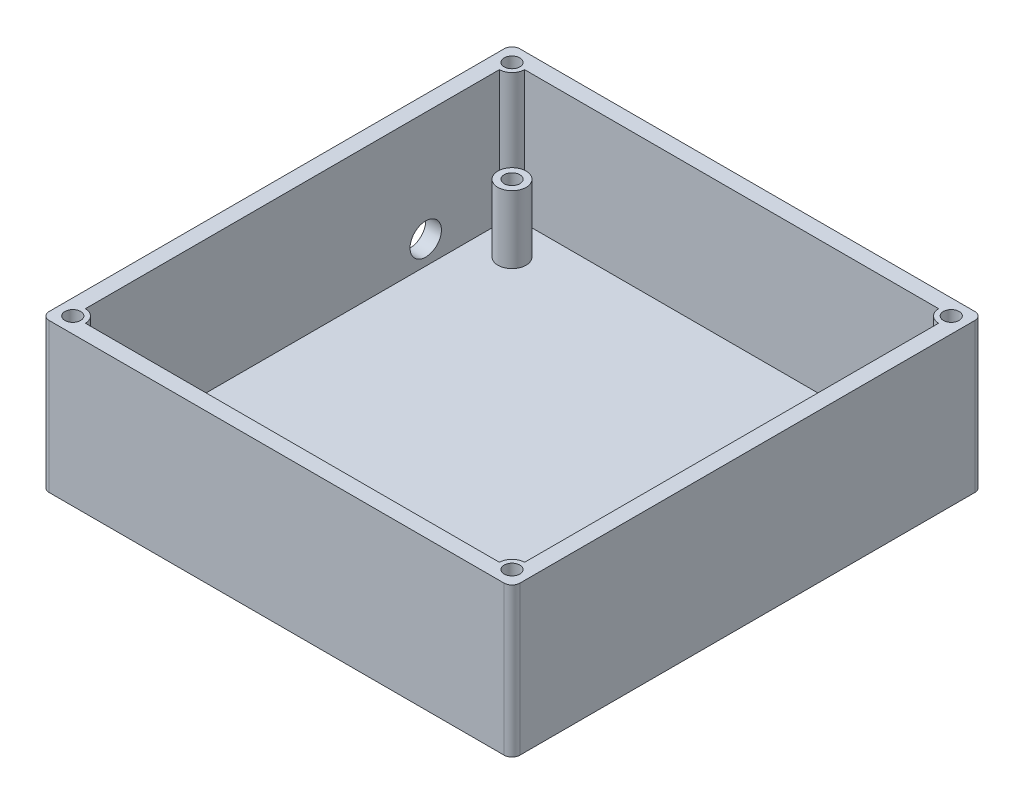
ISO-10303-21;
HEADER;
FILE_DESCRIPTION(('STEP AP214'),'2;1');
FILE_NAME('part.step','',(''),(''),'','','');
FILE_SCHEMA(('AUTOMOTIVE_DESIGN { 1 0 10303 214 1 1 1 1 }'));
ENDSEC;
DATA;
#1=APPLICATION_CONTEXT('core data for automotive mechanical design processes');
#2=APPLICATION_PROTOCOL_DEFINITION('international standard','automotive_design',2000,#1);
#3=PRODUCT_CONTEXT('',#1,'mechanical');
#4=PRODUCT('Part','Part','',(#3));
#5=PRODUCT_RELATED_PRODUCT_CATEGORY('part','',(#4));
#6=PRODUCT_DEFINITION_FORMATION('','',#4);
#7=PRODUCT_DEFINITION_CONTEXT('part definition',#1,'design');
#8=PRODUCT_DEFINITION('design','',#6,#7);
#9=PRODUCT_DEFINITION_SHAPE('','',#8);
#10=(LENGTH_UNIT() NAMED_UNIT(*) SI_UNIT(.MILLI.,.METRE.));
#11=(NAMED_UNIT(*) PLANE_ANGLE_UNIT() SI_UNIT($,.RADIAN.));
#12=(NAMED_UNIT(*) SI_UNIT($,.STERADIAN.) SOLID_ANGLE_UNIT());
#13=UNCERTAINTY_MEASURE_WITH_UNIT(LENGTH_MEASURE(1.E-05),#10,'distance_accuracy_value','');
#14=(GEOMETRIC_REPRESENTATION_CONTEXT(3) GLOBAL_UNCERTAINTY_ASSIGNED_CONTEXT((#13)) GLOBAL_UNIT_ASSIGNED_CONTEXT((#10,
#11,#12)) REPRESENTATION_CONTEXT('',''));
#15=CARTESIAN_POINT('',(0.,0.,0.));
#16=DIRECTION('',(0.,0.,1.));
#17=DIRECTION('',(1.,0.,0.));
#18=AXIS2_PLACEMENT_3D('',#15,#16,#17);
#19=CARTESIAN_POINT('',(28.,19.,28.));
#20=DIRECTION('',(0.,0.,-1.));
#21=DIRECTION('',(-1.,0.,0.));
#22=AXIS2_PLACEMENT_3D('',#19,#20,#21);
#23=PLANE('',#22);
#24=DIRECTION('',(1.,0.,0.));
#25=VECTOR('',#24,1.);
#26=CARTESIAN_POINT('',(-28.,2.,28.));
#27=LINE('',#26,#25);
#28=CARTESIAN_POINT('',(-26.4,2.,28.));
#29=VERTEX_POINT('',#28);
#30=CARTESIAN_POINT('',(26.4,2.,28.));
#31=VERTEX_POINT('',#30);
#32=EDGE_CURVE('E164',#29,#31,#27,.T.);
#33=ORIENTED_EDGE('',*,*,#32,.F.);
#34=DIRECTION('',(0.,-1.,0.));
#35=VECTOR('',#34,1.);
#36=CARTESIAN_POINT('',(-26.4,19.,28.));
#37=LINE('',#36,#35);
#38=CARTESIAN_POINT('',(-26.4,19.,28.));
#39=VERTEX_POINT('',#38);
#40=EDGE_CURVE('E174',#29,#39,#37,.F.);
#41=ORIENTED_EDGE('',*,*,#40,.T.);
#42=DIRECTION('',(1.,0.,0.));
#43=VECTOR('',#42,1.);
#44=CARTESIAN_POINT('',(28.,19.,28.));
#45=LINE('',#44,#43);
#46=CARTESIAN_POINT('',(26.4,19.,28.));
#47=VERTEX_POINT('',#46);
#48=EDGE_CURVE('E218',#39,#47,#45,.T.);
#49=ORIENTED_EDGE('',*,*,#48,.T.);
#50=DIRECTION('',(0.,-1.,0.));
#51=VECTOR('',#50,1.);
#52=CARTESIAN_POINT('',(26.4,19.,28.));
#53=LINE('',#52,#51);
#54=EDGE_CURVE('E304',#47,#31,#53,.T.);
#55=ORIENTED_EDGE('',*,*,#54,.T.);
#56=EDGE_LOOP('',(#33,#41,#49,#55));
#57=FACE_BOUND('',#56,.T.);
#58=ADVANCED_FACE('F39',(#57),#23,.T.);
#59=CARTESIAN_POINT('',(-28.,19.,28.));
#60=DIRECTION('',(1.,0.,0.));
#61=DIRECTION('',(0.,0.,-1.));
#62=AXIS2_PLACEMENT_3D('',#59,#60,#61);
#63=PLANE('',#62);
#64=CARTESIAN_POINT('',(-28.,5.,-17.));
#65=DIRECTION('',(-1.,0.,0.));
#66=DIRECTION('',(0.,0.,1.));
#67=AXIS2_PLACEMENT_3D('',#64,#65,#66);
#68=CIRCLE('',#67,2.);
#69=CARTESIAN_POINT('',(-28.,5.,-15.));
#70=VERTEX_POINT('',#69);
#71=EDGE_CURVE('E215',#70,#70,#68,.T.);
#72=ORIENTED_EDGE('',*,*,#71,.T.);
#73=EDGE_LOOP('',(#72));
#74=FACE_BOUND('',#73,.T.);
#75=DIRECTION('',(0.,0.,1.));
#76=VECTOR('',#75,1.);
#77=CARTESIAN_POINT('',(-28.,19.,28.));
#78=LINE('',#77,#76);
#79=CARTESIAN_POINT('',(-28.,19.,-26.4));
#80=VERTEX_POINT('',#79);
#81=CARTESIAN_POINT('',(-28.,19.,26.4));
#82=VERTEX_POINT('',#81);
#83=EDGE_CURVE('E170',#80,#82,#78,.T.);
#84=ORIENTED_EDGE('',*,*,#83,.T.);
#85=DIRECTION('',(0.,-1.,0.));
#86=VECTOR('',#85,1.);
#87=CARTESIAN_POINT('',(-28.,19.,26.4));
#88=LINE('',#87,#86);
#89=CARTESIAN_POINT('',(-28.,2.,26.4));
#90=VERTEX_POINT('',#89);
#91=EDGE_CURVE('E168',#82,#90,#88,.T.);
#92=ORIENTED_EDGE('',*,*,#91,.T.);
#93=DIRECTION('',(0.,0.,1.));
#94=VECTOR('',#93,1.);
#95=CARTESIAN_POINT('',(-28.,2.,28.));
#96=LINE('',#95,#94);
#97=CARTESIAN_POINT('',(-28.,2.,-26.4));
#98=VERTEX_POINT('',#97);
#99=EDGE_CURVE('E152',#98,#90,#96,.T.);
#100=ORIENTED_EDGE('',*,*,#99,.F.);
#101=DIRECTION('',(0.,-1.,0.));
#102=VECTOR('',#101,1.);
#103=CARTESIAN_POINT('',(-28.,19.,-26.4));
#104=LINE('',#103,#102);
#105=EDGE_CURVE('E302',#98,#80,#104,.F.);
#106=ORIENTED_EDGE('',*,*,#105,.T.);
#107=EDGE_LOOP('',(#84,#92,#100,#106));
#108=FACE_BOUND('',#107,.T.);
#109=ADVANCED_FACE('F169',(#74,#108),#63,.T.);
#110=CARTESIAN_POINT('',(28.,19.,-28.));
#111=DIRECTION('',(-1.,0.,0.));
#112=DIRECTION('',(0.,0.,1.));
#113=AXIS2_PLACEMENT_3D('',#110,#111,#112);
#114=PLANE('',#113);
#115=DIRECTION('',(0.,0.,-1.));
#116=VECTOR('',#115,1.);
#117=CARTESIAN_POINT('',(28.,2.,28.));
#118=LINE('',#117,#116);
#119=CARTESIAN_POINT('',(28.,2.,26.4));
#120=VERTEX_POINT('',#119);
#121=CARTESIAN_POINT('',(28.,2.,-26.4));
#122=VERTEX_POINT('',#121);
#123=EDGE_CURVE('E286',#120,#122,#118,.T.);
#124=ORIENTED_EDGE('',*,*,#123,.F.);
#125=DIRECTION('',(0.,-1.,0.));
#126=VECTOR('',#125,1.);
#127=CARTESIAN_POINT('',(28.,19.,26.4));
#128=LINE('',#127,#126);
#129=CARTESIAN_POINT('',(28.,19.,26.4));
#130=VERTEX_POINT('',#129);
#131=EDGE_CURVE('E192',#120,#130,#128,.F.);
#132=ORIENTED_EDGE('',*,*,#131,.T.);
#133=DIRECTION('',(0.,0.,-1.));
#134=VECTOR('',#133,1.);
#135=CARTESIAN_POINT('',(28.,19.,-28.));
#136=LINE('',#135,#134);
#137=CARTESIAN_POINT('',(28.,19.,-26.4));
#138=VERTEX_POINT('',#137);
#139=EDGE_CURVE('E238',#130,#138,#136,.T.);
#140=ORIENTED_EDGE('',*,*,#139,.T.);
#141=DIRECTION('',(0.,-1.,0.));
#142=VECTOR('',#141,1.);
#143=CARTESIAN_POINT('',(28.,19.,-26.4));
#144=LINE('',#143,#142);
#145=EDGE_CURVE('E200',#138,#122,#144,.T.);
#146=ORIENTED_EDGE('',*,*,#145,.T.);
#147=EDGE_LOOP('',(#124,#132,#140,#146));
#148=FACE_BOUND('',#147,.T.);
#149=ADVANCED_FACE('F379',(#148),#114,.T.);
#150=CARTESIAN_POINT('',(-28.,19.,-28.));
#151=DIRECTION('',(0.,0.,1.));
#152=DIRECTION('',(1.,0.,0.));
#153=AXIS2_PLACEMENT_3D('',#150,#151,#152);
#154=PLANE('',#153);
#155=DIRECTION('',(-1.,0.,0.));
#156=VECTOR('',#155,1.);
#157=CARTESIAN_POINT('',(-28.,2.,-28.));
#158=LINE('',#157,#156);
#159=CARTESIAN_POINT('',(26.4,2.,-28.));
#160=VERTEX_POINT('',#159);
#161=CARTESIAN_POINT('',(-26.4,2.,-28.));
#162=VERTEX_POINT('',#161);
#163=EDGE_CURVE('E165',#160,#162,#158,.T.);
#164=ORIENTED_EDGE('',*,*,#163,.F.);
#165=DIRECTION('',(0.,-1.,0.));
#166=VECTOR('',#165,1.);
#167=CARTESIAN_POINT('',(26.4,19.,-28.));
#168=LINE('',#167,#166);
#169=CARTESIAN_POINT('',(26.4,19.,-28.));
#170=VERTEX_POINT('',#169);
#171=EDGE_CURVE('E205',#160,#170,#168,.F.);
#172=ORIENTED_EDGE('',*,*,#171,.T.);
#173=DIRECTION('',(-1.,0.,0.));
#174=VECTOR('',#173,1.);
#175=CARTESIAN_POINT('',(-28.,19.,-28.));
#176=LINE('',#175,#174);
#177=CARTESIAN_POINT('',(-26.4,19.,-28.));
#178=VERTEX_POINT('',#177);
#179=EDGE_CURVE('E233',#170,#178,#176,.T.);
#180=ORIENTED_EDGE('',*,*,#179,.T.);
#181=DIRECTION('',(0.,-1.,0.));
#182=VECTOR('',#181,1.);
#183=CARTESIAN_POINT('',(-26.4,19.,-28.));
#184=LINE('',#183,#182);
#185=EDGE_CURVE('E210',#178,#162,#184,.T.);
#186=ORIENTED_EDGE('',*,*,#185,.T.);
#187=EDGE_LOOP('',(#164,#172,#180,#186));
#188=FACE_BOUND('',#187,.T.);
#189=ADVANCED_FACE('F389',(#188),#154,.T.);
#190=CARTESIAN_POINT('',(0.,2.,0.));
#191=DIRECTION('',(0.,-1.,0.));
#192=DIRECTION('',(0.,0.,-1.));
#193=AXIS2_PLACEMENT_3D('',#190,#191,#192);
#194=PLANE('',#193);
#195=CARTESIAN_POINT('',(-28.,2.,28.));
#196=DIRECTION('',(0.,1.,0.));
#197=DIRECTION('',(0.,0.,1.));
#198=AXIS2_PLACEMENT_3D('',#195,#196,#197);
#199=CIRCLE('',#198,1.6);
#200=EDGE_CURVE('E157',#29,#90,#199,.T.);
#201=ORIENTED_EDGE('',*,*,#200,.F.);
#202=ORIENTED_EDGE('',*,*,#32,.T.);
#203=CARTESIAN_POINT('',(28.,2.,28.));
#204=DIRECTION('',(0.,1.,0.));
#205=DIRECTION('',(0.,0.,1.));
#206=AXIS2_PLACEMENT_3D('',#203,#204,#205);
#207=CIRCLE('',#206,1.6);
#208=EDGE_CURVE('E188',#120,#31,#207,.T.);
#209=ORIENTED_EDGE('',*,*,#208,.F.);
#210=ORIENTED_EDGE('',*,*,#123,.T.);
#211=CARTESIAN_POINT('',(28.,2.,-28.));
#212=DIRECTION('',(0.,1.,0.));
#213=DIRECTION('',(0.,0.,1.));
#214=AXIS2_PLACEMENT_3D('',#211,#212,#213);
#215=CIRCLE('',#214,1.6);
#216=EDGE_CURVE('E196',#160,#122,#215,.T.);
#217=ORIENTED_EDGE('',*,*,#216,.F.);
#218=ORIENTED_EDGE('',*,*,#163,.T.);
#219=CARTESIAN_POINT('',(-28.,2.,-28.));
#220=DIRECTION('',(0.,1.,0.));
#221=DIRECTION('',(0.,0.,1.));
#222=AXIS2_PLACEMENT_3D('',#219,#220,#221);
#223=CIRCLE('',#222,1.6);
#224=EDGE_CURVE('E160',#98,#162,#223,.T.);
#225=ORIENTED_EDGE('',*,*,#224,.F.);
#226=ORIENTED_EDGE('',*,*,#99,.T.);
#227=EDGE_LOOP('',(#201,#202,#209,#210,#217,#218,#225,#226));
#228=FACE_BOUND('',#227,.T.);
#229=CARTESIAN_POINT('',(23.5,2.,23.5));
#230=DIRECTION('',(0.,-1.,0.));
#231=DIRECTION('',(0.,0.,-1.));
#232=AXIS2_PLACEMENT_3D('',#229,#230,#231);
#233=CIRCLE('',#232,1.8);
#234=CARTESIAN_POINT('',(23.5,2.,21.7));
#235=VERTEX_POINT('',#234);
#236=EDGE_CURVE('E299',#235,#235,#233,.F.);
#237=ORIENTED_EDGE('',*,*,#236,.F.);
#238=EDGE_LOOP('',(#237));
#239=FACE_BOUND('',#238,.T.);
#240=CARTESIAN_POINT('',(23.5,2.,-23.5));
#241=DIRECTION('',(0.,-1.,0.));
#242=DIRECTION('',(0.,0.,-1.));
#243=AXIS2_PLACEMENT_3D('',#240,#241,#242);
#244=CIRCLE('',#243,1.8);
#245=CARTESIAN_POINT('',(23.5,2.,-25.3));
#246=VERTEX_POINT('',#245);
#247=EDGE_CURVE('E296',#246,#246,#244,.F.);
#248=ORIENTED_EDGE('',*,*,#247,.F.);
#249=EDGE_LOOP('',(#248));
#250=FACE_BOUND('',#249,.T.);
#251=CARTESIAN_POINT('',(-23.5,2.,-23.5));
#252=DIRECTION('',(0.,-1.,0.));
#253=DIRECTION('',(0.,0.,-1.));
#254=AXIS2_PLACEMENT_3D('',#251,#252,#253);
#255=CIRCLE('',#254,1.8);
#256=CARTESIAN_POINT('',(-23.5,2.,-25.3));
#257=VERTEX_POINT('',#256);
#258=EDGE_CURVE('E293',#257,#257,#255,.F.);
#259=ORIENTED_EDGE('',*,*,#258,.F.);
#260=EDGE_LOOP('',(#259));
#261=FACE_BOUND('',#260,.T.);
#262=CARTESIAN_POINT('',(-23.5,2.,23.5));
#263=DIRECTION('',(0.,-1.,0.));
#264=DIRECTION('',(0.,0.,-1.));
#265=AXIS2_PLACEMENT_3D('',#262,#263,#264);
#266=CIRCLE('',#265,1.8);
#267=CARTESIAN_POINT('',(-23.5,2.,21.7));
#268=VERTEX_POINT('',#267);
#269=EDGE_CURVE('E290',#268,#268,#266,.F.);
#270=ORIENTED_EDGE('',*,*,#269,.F.);
#271=EDGE_LOOP('',(#270));
#272=FACE_BOUND('',#271,.T.);
#273=ADVANCED_FACE('F154',(#228,#239,#250,#261,#272),#194,.F.);
#274=CARTESIAN_POINT('',(0.,0.,0.));
#275=DIRECTION('',(0.,-1.,0.));
#276=DIRECTION('',(0.,0.,-1.));
#277=AXIS2_PLACEMENT_3D('',#274,#275,#276);
#278=PLANE('',#277);
#279=DIRECTION('',(0.,0.,-1.));
#280=VECTOR('',#279,1.);
#281=CARTESIAN_POINT('',(-30.,0.,28.));
#282=LINE('',#281,#280);
#283=CARTESIAN_POINT('',(-30.,0.,28.9999999999999));
#284=VERTEX_POINT('',#283);
#285=CARTESIAN_POINT('',(-30.,0.,-29.));
#286=VERTEX_POINT('',#285);
#287=EDGE_CURVE('E222',#284,#286,#282,.T.);
#288=ORIENTED_EDGE('',*,*,#287,.T.);
#289=CARTESIAN_POINT('',(-29.,0.,-29.));
#290=DIRECTION('',(0.,-1.,0.));
#291=DIRECTION('',(0.,0.,-1.));
#292=AXIS2_PLACEMENT_3D('',#289,#290,#291);
#293=CIRCLE('',#292,1.);
#294=CARTESIAN_POINT('',(-29.,0.,-30.));
#295=VERTEX_POINT('',#294);
#296=EDGE_CURVE('E318',#286,#295,#293,.T.);
#297=ORIENTED_EDGE('',*,*,#296,.T.);
#298=DIRECTION('',(1.,0.,0.));
#299=VECTOR('',#298,1.);
#300=CARTESIAN_POINT('',(-28.,0.,-30.));
#301=LINE('',#300,#299);
#302=CARTESIAN_POINT('',(29.,0.,-30.));
#303=VERTEX_POINT('',#302);
#304=EDGE_CURVE('E227',#295,#303,#301,.T.);
#305=ORIENTED_EDGE('',*,*,#304,.T.);
#306=CARTESIAN_POINT('',(29.,0.,-29.));
#307=DIRECTION('',(0.,-1.,0.));
#308=DIRECTION('',(0.,0.,-1.));
#309=AXIS2_PLACEMENT_3D('',#306,#307,#308);
#310=CIRCLE('',#309,1.);
#311=CARTESIAN_POINT('',(30.,0.,-29.));
#312=VERTEX_POINT('',#311);
#313=EDGE_CURVE('E316',#303,#312,#310,.T.);
#314=ORIENTED_EDGE('',*,*,#313,.T.);
#315=DIRECTION('',(0.,0.,1.));
#316=VECTOR('',#315,1.);
#317=CARTESIAN_POINT('',(30.,0.,-28.));
#318=LINE('',#317,#316);
#319=CARTESIAN_POINT('',(30.,0.,29.));
#320=VERTEX_POINT('',#319);
#321=EDGE_CURVE('E235',#312,#320,#318,.T.);
#322=ORIENTED_EDGE('',*,*,#321,.T.);
#323=CARTESIAN_POINT('',(29.,0.,29.));
#324=DIRECTION('',(0.,-1.,0.));
#325=DIRECTION('',(0.,0.,-1.));
#326=AXIS2_PLACEMENT_3D('',#323,#324,#325);
#327=CIRCLE('',#326,1.);
#328=CARTESIAN_POINT('',(29.,0.,30.));
#329=VERTEX_POINT('',#328);
#330=EDGE_CURVE('E314',#320,#329,#327,.T.);
#331=ORIENTED_EDGE('',*,*,#330,.T.);
#332=DIRECTION('',(-1.,0.,0.));
#333=VECTOR('',#332,1.);
#334=CARTESIAN_POINT('',(28.,0.,30.));
#335=LINE('',#334,#333);
#336=CARTESIAN_POINT('',(-29.,0.,29.9999999999999));
#337=VERTEX_POINT('',#336);
#338=EDGE_CURVE('E241',#329,#337,#335,.T.);
#339=ORIENTED_EDGE('',*,*,#338,.T.);
#340=CARTESIAN_POINT('',(-29.,0.,28.9999999999999));
#341=DIRECTION('',(0.,-1.,0.));
#342=DIRECTION('',(0.,0.,-1.));
#343=AXIS2_PLACEMENT_3D('',#340,#341,#342);
#344=CIRCLE('',#343,1.);
#345=EDGE_CURVE('E312',#337,#284,#344,.T.);
#346=ORIENTED_EDGE('',*,*,#345,.T.);
#347=EDGE_LOOP('',(#288,#297,#305,#314,#322,#331,#339,#346));
#348=FACE_BOUND('',#347,.T.);
#349=ADVANCED_FACE('F344',(#348),#278,.T.);
#350=CARTESIAN_POINT('',(-23.5,10.6,23.5));
#351=DIRECTION('',(0.,-1.,0.));
#352=DIRECTION('',(0.,0.,-1.));
#353=AXIS2_PLACEMENT_3D('',#350,#351,#352);
#354=CYLINDRICAL_SURFACE('',#353,1.8);
#355=CARTESIAN_POINT('',(-23.5,10.6,23.5));
#356=DIRECTION('',(0.,1.,0.));
#357=DIRECTION('',(0.,0.,1.));
#358=AXIS2_PLACEMENT_3D('',#355,#356,#357);
#359=CIRCLE('',#358,1.8);
#360=CARTESIAN_POINT('',(-23.5,10.6,25.3));
#361=VERTEX_POINT('',#360);
#362=EDGE_CURVE('E283',#361,#361,#359,.T.);
#363=ORIENTED_EDGE('',*,*,#362,.F.);
#364=EDGE_LOOP('',(#363));
#365=FACE_BOUND('',#364,.T.);
#366=ORIENTED_EDGE('',*,*,#269,.T.);
#367=EDGE_LOOP('',(#366));
#368=FACE_BOUND('',#367,.T.);
#369=ADVANCED_FACE('F463',(#365,#368),#354,.T.);
#370=CARTESIAN_POINT('',(-23.5,10.6,23.5));
#371=DIRECTION('',(0.,1.,0.));
#372=DIRECTION('',(0.,0.,1.));
#373=AXIS2_PLACEMENT_3D('',#370,#371,#372);
#374=PLANE('',#373);
#375=CARTESIAN_POINT('',(-23.5,10.6,23.5160513039989));
#376=DIRECTION('',(0.,1.,0.));
#377=DIRECTION('',(0.,0.,1.));
#378=AXIS2_PLACEMENT_3D('',#375,#376,#377);
#379=CIRCLE('',#378,1.);
#380=CARTESIAN_POINT('',(-23.5,10.6,24.5160513039989));
#381=VERTEX_POINT('',#380);
#382=EDGE_CURVE('E246',#381,#381,#379,.T.);
#383=ORIENTED_EDGE('',*,*,#382,.F.);
#384=EDGE_LOOP('',(#383));
#385=FACE_BOUND('',#384,.T.);
#386=ORIENTED_EDGE('',*,*,#362,.T.);
#387=EDGE_LOOP('',(#386));
#388=FACE_BOUND('',#387,.T.);
#389=ADVANCED_FACE('F459',(#385,#388),#374,.T.);
#390=CARTESIAN_POINT('',(-23.5,10.6,-23.5));
#391=DIRECTION('',(0.,-1.,0.));
#392=DIRECTION('',(0.,0.,-1.));
#393=AXIS2_PLACEMENT_3D('',#390,#391,#392);
#394=CYLINDRICAL_SURFACE('',#393,1.8);
#395=CARTESIAN_POINT('',(-23.5,10.6,-23.5));
#396=DIRECTION('',(0.,1.,0.));
#397=DIRECTION('',(0.,0.,1.));
#398=AXIS2_PLACEMENT_3D('',#395,#396,#397);
#399=CIRCLE('',#398,1.8);
#400=CARTESIAN_POINT('',(-23.5,10.6,-21.7));
#401=VERTEX_POINT('',#400);
#402=EDGE_CURVE('E280',#401,#401,#399,.T.);
#403=ORIENTED_EDGE('',*,*,#402,.F.);
#404=EDGE_LOOP('',(#403));
#405=FACE_BOUND('',#404,.T.);
#406=ORIENTED_EDGE('',*,*,#258,.T.);
#407=EDGE_LOOP('',(#406));
#408=FACE_BOUND('',#407,.T.);
#409=ADVANCED_FACE('F455',(#405,#408),#394,.T.);
#410=CARTESIAN_POINT('',(-23.5,10.6,-23.5));
#411=DIRECTION('',(0.,1.,0.));
#412=DIRECTION('',(0.,0.,1.));
#413=AXIS2_PLACEMENT_3D('',#410,#411,#412);
#414=PLANE('',#413);
#415=CARTESIAN_POINT('',(-23.5,10.6,-23.5));
#416=DIRECTION('',(0.,1.,0.));
#417=DIRECTION('',(0.,0.,1.));
#418=AXIS2_PLACEMENT_3D('',#415,#416,#417);
#419=CIRCLE('',#418,1.);
#420=CARTESIAN_POINT('',(-23.5,10.6,-22.5));
#421=VERTEX_POINT('',#420);
#422=EDGE_CURVE('E254',#421,#421,#419,.T.);
#423=ORIENTED_EDGE('',*,*,#422,.F.);
#424=EDGE_LOOP('',(#423));
#425=FACE_BOUND('',#424,.T.);
#426=ORIENTED_EDGE('',*,*,#402,.T.);
#427=EDGE_LOOP('',(#426));
#428=FACE_BOUND('',#427,.T.);
#429=ADVANCED_FACE('F451',(#425,#428),#414,.T.);
#430=CARTESIAN_POINT('',(23.5,10.6,-23.5));
#431=DIRECTION('',(0.,-1.,0.));
#432=DIRECTION('',(0.,0.,-1.));
#433=AXIS2_PLACEMENT_3D('',#430,#431,#432);
#434=CYLINDRICAL_SURFACE('',#433,1.8);
#435=CARTESIAN_POINT('',(23.5,10.6,-23.5));
#436=DIRECTION('',(0.,1.,0.));
#437=DIRECTION('',(0.,0.,1.));
#438=AXIS2_PLACEMENT_3D('',#435,#436,#437);
#439=CIRCLE('',#438,1.8);
#440=CARTESIAN_POINT('',(23.5,10.6,-21.7));
#441=VERTEX_POINT('',#440);
#442=EDGE_CURVE('E277',#441,#441,#439,.T.);
#443=ORIENTED_EDGE('',*,*,#442,.F.);
#444=EDGE_LOOP('',(#443));
#445=FACE_BOUND('',#444,.T.);
#446=ORIENTED_EDGE('',*,*,#247,.T.);
#447=EDGE_LOOP('',(#446));
#448=FACE_BOUND('',#447,.T.);
#449=ADVANCED_FACE('F447',(#445,#448),#434,.T.);
#450=CARTESIAN_POINT('',(23.5,10.6,-23.5));
#451=DIRECTION('',(0.,1.,0.));
#452=DIRECTION('',(0.,0.,1.));
#453=AXIS2_PLACEMENT_3D('',#450,#451,#452);
#454=PLANE('',#453);
#455=CARTESIAN_POINT('',(23.5,10.6,-23.4724717001792));
#456=DIRECTION('',(0.,1.,0.));
#457=DIRECTION('',(0.,0.,1.));
#458=AXIS2_PLACEMENT_3D('',#455,#456,#457);
#459=CIRCLE('',#458,1.);
#460=CARTESIAN_POINT('',(23.5,10.6,-22.4724717001792));
#461=VERTEX_POINT('',#460);
#462=EDGE_CURVE('E255',#461,#461,#459,.T.);
#463=ORIENTED_EDGE('',*,*,#462,.F.);
#464=EDGE_LOOP('',(#463));
#465=FACE_BOUND('',#464,.T.);
#466=ORIENTED_EDGE('',*,*,#442,.T.);
#467=EDGE_LOOP('',(#466));
#468=FACE_BOUND('',#467,.T.);
#469=ADVANCED_FACE('F443',(#465,#468),#454,.T.);
#470=CARTESIAN_POINT('',(23.5,10.6,23.5));
#471=DIRECTION('',(0.,-1.,0.));
#472=DIRECTION('',(0.,0.,-1.));
#473=AXIS2_PLACEMENT_3D('',#470,#471,#472);
#474=CYLINDRICAL_SURFACE('',#473,1.8);
#475=CARTESIAN_POINT('',(23.5,10.6,23.5));
#476=DIRECTION('',(0.,1.,0.));
#477=DIRECTION('',(0.,0.,1.));
#478=AXIS2_PLACEMENT_3D('',#475,#476,#477);
#479=CIRCLE('',#478,1.8);
#480=CARTESIAN_POINT('',(23.5,10.6,25.3));
#481=VERTEX_POINT('',#480);
#482=EDGE_CURVE('E272',#481,#481,#479,.T.);
#483=ORIENTED_EDGE('',*,*,#482,.F.);
#484=EDGE_LOOP('',(#483));
#485=FACE_BOUND('',#484,.T.);
#486=ORIENTED_EDGE('',*,*,#236,.T.);
#487=EDGE_LOOP('',(#486));
#488=FACE_BOUND('',#487,.T.);
#489=ADVANCED_FACE('F439',(#485,#488),#474,.T.);
#490=CARTESIAN_POINT('',(23.5,10.6,23.5));
#491=DIRECTION('',(0.,1.,0.));
#492=DIRECTION('',(0.,0.,1.));
#493=AXIS2_PLACEMENT_3D('',#490,#491,#492);
#494=PLANE('',#493);
#495=CARTESIAN_POINT('',(23.5,10.6,23.5));
#496=DIRECTION('',(0.,1.,0.));
#497=DIRECTION('',(0.,0.,1.));
#498=AXIS2_PLACEMENT_3D('',#495,#496,#497);
#499=CIRCLE('',#498,1.);
#500=CARTESIAN_POINT('',(23.5,10.6,24.5));
#501=VERTEX_POINT('',#500);
#502=EDGE_CURVE('E261',#501,#501,#499,.T.);
#503=ORIENTED_EDGE('',*,*,#502,.F.);
#504=EDGE_LOOP('',(#503));
#505=FACE_BOUND('',#504,.T.);
#506=ORIENTED_EDGE('',*,*,#482,.T.);
#507=EDGE_LOOP('',(#506));
#508=FACE_BOUND('',#507,.T.);
#509=ADVANCED_FACE('F422',(#505,#508),#494,.T.);
#510=CARTESIAN_POINT('',(23.5,2.,23.5));
#511=DIRECTION('',(0.,1.,0.));
#512=DIRECTION('',(0.,0.,1.));
#513=AXIS2_PLACEMENT_3D('',#510,#511,#512);
#514=CYLINDRICAL_SURFACE('',#513,1.);
#515=CARTESIAN_POINT('',(23.5,2.,23.5));
#516=DIRECTION('',(0.,1.,0.));
#517=DIRECTION('',(0.,0.,1.));
#518=AXIS2_PLACEMENT_3D('',#515,#516,#517);
#519=CIRCLE('',#518,1.);
#520=CARTESIAN_POINT('',(23.5,2.,24.5));
#521=VERTEX_POINT('',#520);
#522=EDGE_CURVE('E258',#521,#521,#519,.T.);
#523=ORIENTED_EDGE('',*,*,#522,.F.);
#524=EDGE_LOOP('',(#523));
#525=FACE_BOUND('',#524,.T.);
#526=ORIENTED_EDGE('',*,*,#502,.T.);
#527=EDGE_LOOP('',(#526));
#528=FACE_BOUND('',#527,.T.);
#529=ADVANCED_FACE('F418',(#525,#528),#514,.F.);
#530=CARTESIAN_POINT('',(23.5,2.,23.5));
#531=DIRECTION('',(0.,1.,0.));
#532=DIRECTION('',(0.,0.,1.));
#533=AXIS2_PLACEMENT_3D('',#530,#531,#532);
#534=PLANE('',#533);
#535=ORIENTED_EDGE('',*,*,#522,.T.);
#536=EDGE_LOOP('',(#535));
#537=FACE_BOUND('',#536,.T.);
#538=ADVANCED_FACE('F414',(#537),#534,.T.);
#539=CARTESIAN_POINT('',(23.5,2.,-23.4724717001792));
#540=DIRECTION('',(0.,1.,0.));
#541=DIRECTION('',(0.,0.,1.));
#542=AXIS2_PLACEMENT_3D('',#539,#540,#541);
#543=CYLINDRICAL_SURFACE('',#542,1.);
#544=CARTESIAN_POINT('',(23.5,2.,-23.4724717001792));
#545=DIRECTION('',(0.,1.,0.));
#546=DIRECTION('',(0.,0.,1.));
#547=AXIS2_PLACEMENT_3D('',#544,#545,#546);
#548=CIRCLE('',#547,1.);
#549=CARTESIAN_POINT('',(23.5,2.,-22.4724717001792));
#550=VERTEX_POINT('',#549);
#551=EDGE_CURVE('E251',#550,#550,#548,.T.);
#552=ORIENTED_EDGE('',*,*,#551,.F.);
#553=EDGE_LOOP('',(#552));
#554=FACE_BOUND('',#553,.T.);
#555=ORIENTED_EDGE('',*,*,#462,.T.);
#556=EDGE_LOOP('',(#555));
#557=FACE_BOUND('',#556,.T.);
#558=ADVANCED_FACE('F410',(#554,#557),#543,.F.);
#559=CARTESIAN_POINT('',(23.5,2.,-23.4724717001792));
#560=DIRECTION('',(0.,1.,0.));
#561=DIRECTION('',(0.,0.,1.));
#562=AXIS2_PLACEMENT_3D('',#559,#560,#561);
#563=PLANE('',#562);
#564=ORIENTED_EDGE('',*,*,#551,.T.);
#565=EDGE_LOOP('',(#564));
#566=FACE_BOUND('',#565,.T.);
#567=ADVANCED_FACE('F406',(#566),#563,.T.);
#568=CARTESIAN_POINT('',(-23.5,2.,-23.5));
#569=DIRECTION('',(0.,1.,0.));
#570=DIRECTION('',(0.,0.,1.));
#571=AXIS2_PLACEMENT_3D('',#568,#569,#570);
#572=CYLINDRICAL_SURFACE('',#571,1.);
#573=CARTESIAN_POINT('',(-23.5,2.,-23.5));
#574=DIRECTION('',(0.,1.,0.));
#575=DIRECTION('',(0.,0.,1.));
#576=AXIS2_PLACEMENT_3D('',#573,#574,#575);
#577=CIRCLE('',#576,1.);
#578=CARTESIAN_POINT('',(-23.5,2.,-22.5));
#579=VERTEX_POINT('',#578);
#580=EDGE_CURVE('E269',#579,#579,#577,.T.);
#581=ORIENTED_EDGE('',*,*,#580,.F.);
#582=EDGE_LOOP('',(#581));
#583=FACE_BOUND('',#582,.T.);
#584=ORIENTED_EDGE('',*,*,#422,.T.);
#585=EDGE_LOOP('',(#584));
#586=FACE_BOUND('',#585,.T.);
#587=ADVANCED_FACE('F409',(#583,#586),#572,.F.);
#588=CARTESIAN_POINT('',(-23.5,2.,-23.5));
#589=DIRECTION('',(0.,1.,0.));
#590=DIRECTION('',(0.,0.,1.));
#591=AXIS2_PLACEMENT_3D('',#588,#589,#590);
#592=PLANE('',#591);
#593=ORIENTED_EDGE('',*,*,#580,.T.);
#594=EDGE_LOOP('',(#593));
#595=FACE_BOUND('',#594,.T.);
#596=ADVANCED_FACE('F429',(#595),#592,.T.);
#597=CARTESIAN_POINT('',(-23.5,2.,23.5160513039989));
#598=DIRECTION('',(0.,1.,0.));
#599=DIRECTION('',(0.,0.,1.));
#600=AXIS2_PLACEMENT_3D('',#597,#598,#599);
#601=CYLINDRICAL_SURFACE('',#600,1.);
#602=CARTESIAN_POINT('',(-23.5,2.,23.5160513039989));
#603=DIRECTION('',(0.,1.,0.));
#604=DIRECTION('',(0.,0.,1.));
#605=AXIS2_PLACEMENT_3D('',#602,#603,#604);
#606=CIRCLE('',#605,1.);
#607=CARTESIAN_POINT('',(-23.5,2.,24.5160513039989));
#608=VERTEX_POINT('',#607);
#609=EDGE_CURVE('E264',#608,#608,#606,.T.);
#610=ORIENTED_EDGE('',*,*,#609,.F.);
#611=EDGE_LOOP('',(#610));
#612=FACE_BOUND('',#611,.T.);
#613=ORIENTED_EDGE('',*,*,#382,.T.);
#614=EDGE_LOOP('',(#613));
#615=FACE_BOUND('',#614,.T.);
#616=ADVANCED_FACE('F425',(#612,#615),#601,.F.);
#617=CARTESIAN_POINT('',(-23.5,2.,23.5160513039989));
#618=DIRECTION('',(0.,1.,0.));
#619=DIRECTION('',(0.,0.,1.));
#620=AXIS2_PLACEMENT_3D('',#617,#618,#619);
#621=PLANE('',#620);
#622=ORIENTED_EDGE('',*,*,#609,.T.);
#623=EDGE_LOOP('',(#622));
#624=FACE_BOUND('',#623,.T.);
#625=ADVANCED_FACE('F400',(#624),#621,.T.);
#626=CARTESIAN_POINT('',(28.,19.,30.));
#627=DIRECTION('',(0.,0.,1.));
#628=DIRECTION('',(1.,0.,0.));
#629=AXIS2_PLACEMENT_3D('',#626,#627,#628);
#630=PLANE('',#629);
#631=ORIENTED_EDGE('',*,*,#338,.F.);
#632=DIRECTION('',(0.,-1.,0.));
#633=VECTOR('',#632,1.);
#634=CARTESIAN_POINT('',(29.,19.,30.));
#635=LINE('',#634,#633);
#636=CARTESIAN_POINT('',(29.,19.,30.));
#637=VERTEX_POINT('',#636);
#638=EDGE_CURVE('E11',#329,#637,#635,.F.);
#639=ORIENTED_EDGE('',*,*,#638,.T.);
#640=DIRECTION('',(-1.,0.,0.));
#641=VECTOR('',#640,1.);
#642=CARTESIAN_POINT('',(28.,19.,30.));
#643=LINE('',#642,#641);
#644=CARTESIAN_POINT('',(-29.,19.,29.9999999999999));
#645=VERTEX_POINT('',#644);
#646=EDGE_CURVE('E243',#637,#645,#643,.T.);
#647=ORIENTED_EDGE('',*,*,#646,.T.);
#648=DIRECTION('',(0.,-1.,0.));
#649=VECTOR('',#648,1.);
#650=CARTESIAN_POINT('',(-29.,19.,29.9999999999999));
#651=LINE('',#650,#649);
#652=EDGE_CURVE('E47',#645,#337,#651,.T.);
#653=ORIENTED_EDGE('',*,*,#652,.T.);
#654=EDGE_LOOP('',(#631,#639,#647,#653));
#655=FACE_BOUND('',#654,.T.);
#656=ADVANCED_FACE('F339',(#655),#630,.T.);
#657=CARTESIAN_POINT('',(30.,19.,-28.));
#658=DIRECTION('',(1.,0.,0.));
#659=DIRECTION('',(0.,0.,-1.));
#660=AXIS2_PLACEMENT_3D('',#657,#658,#659);
#661=PLANE('',#660);
#662=ORIENTED_EDGE('',*,*,#321,.F.);
#663=DIRECTION('',(0.,-1.,0.));
#664=VECTOR('',#663,1.);
#665=CARTESIAN_POINT('',(30.,19.,-29.));
#666=LINE('',#665,#664);
#667=CARTESIAN_POINT('',(30.,19.,-29.));
#668=VERTEX_POINT('',#667);
#669=EDGE_CURVE('E61',#312,#668,#666,.F.);
#670=ORIENTED_EDGE('',*,*,#669,.T.);
#671=DIRECTION('',(0.,0.,1.));
#672=VECTOR('',#671,1.);
#673=CARTESIAN_POINT('',(30.,19.,-28.));
#674=LINE('',#673,#672);
#675=CARTESIAN_POINT('',(30.,19.,29.));
#676=VERTEX_POINT('',#675);
#677=EDGE_CURVE('E240',#668,#676,#674,.T.);
#678=ORIENTED_EDGE('',*,*,#677,.T.);
#679=DIRECTION('',(0.,-1.,0.));
#680=VECTOR('',#679,1.);
#681=CARTESIAN_POINT('',(30.,19.,29.));
#682=LINE('',#681,#680);
#683=EDGE_CURVE('E332',#676,#320,#682,.T.);
#684=ORIENTED_EDGE('',*,*,#683,.T.);
#685=EDGE_LOOP('',(#662,#670,#678,#684));
#686=FACE_BOUND('',#685,.T.);
#687=ADVANCED_FACE('F349',(#686),#661,.T.);
#688=CARTESIAN_POINT('',(0.,19.,0.));
#689=DIRECTION('',(0.,1.,0.));
#690=DIRECTION('',(0.,0.,1.));
#691=AXIS2_PLACEMENT_3D('',#688,#689,#690);
#692=PLANE('',#691);
#693=CARTESIAN_POINT('',(28.,19.,-28.));
#694=DIRECTION('',(0.,1.,0.));
#695=DIRECTION('',(0.,0.,1.));
#696=AXIS2_PLACEMENT_3D('',#693,#694,#695);
#697=CIRCLE('',#696,1.);
#698=CARTESIAN_POINT('',(28.,19.,-27.));
#699=VERTEX_POINT('',#698);
#700=EDGE_CURVE('E851',#699,#699,#697,.T.);
#701=ORIENTED_EDGE('',*,*,#700,.F.);
#702=EDGE_LOOP('',(#701));
#703=FACE_BOUND('',#702,.T.);
#704=CARTESIAN_POINT('',(-28.,19.,28.));
#705=DIRECTION('',(0.,1.,0.));
#706=DIRECTION('',(0.,0.,1.));
#707=AXIS2_PLACEMENT_3D('',#704,#705,#706);
#708=CIRCLE('',#707,1.);
#709=CARTESIAN_POINT('',(-28.,19.,29.));
#710=VERTEX_POINT('',#709);
#711=EDGE_CURVE('E854',#710,#710,#708,.T.);
#712=ORIENTED_EDGE('',*,*,#711,.F.);
#713=EDGE_LOOP('',(#712));
#714=FACE_BOUND('',#713,.T.);
#715=CARTESIAN_POINT('',(28.,19.,28.));
#716=DIRECTION('',(0.,1.,0.));
#717=DIRECTION('',(0.,0.,1.));
#718=AXIS2_PLACEMENT_3D('',#715,#716,#717);
#719=CIRCLE('',#718,1.);
#720=CARTESIAN_POINT('',(28.,19.,29.));
#721=VERTEX_POINT('',#720);
#722=EDGE_CURVE('E863',#721,#721,#719,.T.);
#723=ORIENTED_EDGE('',*,*,#722,.F.);
#724=EDGE_LOOP('',(#723));
#725=FACE_BOUND('',#724,.T.);
#726=CARTESIAN_POINT('',(-28.,19.,-28.));
#727=DIRECTION('',(0.,1.,0.));
#728=DIRECTION('',(0.,0.,1.));
#729=AXIS2_PLACEMENT_3D('',#726,#727,#728);
#730=CIRCLE('',#729,1.);
#731=CARTESIAN_POINT('',(-28.,19.,-27.));
#732=VERTEX_POINT('',#731);
#733=EDGE_CURVE('E183',#732,#732,#730,.T.);
#734=ORIENTED_EDGE('',*,*,#733,.F.);
#735=EDGE_LOOP('',(#734));
#736=FACE_BOUND('',#735,.T.);
#737=ORIENTED_EDGE('',*,*,#48,.F.);
#738=CARTESIAN_POINT('',(-28.,19.,28.));
#739=DIRECTION('',(0.,1.,0.));
#740=DIRECTION('',(0.,0.,1.));
#741=AXIS2_PLACEMENT_3D('',#738,#739,#740);
#742=CIRCLE('',#741,1.6);
#743=EDGE_CURVE('E175',#39,#82,#742,.T.);
#744=ORIENTED_EDGE('',*,*,#743,.T.);
#745=ORIENTED_EDGE('',*,*,#83,.F.);
#746=CARTESIAN_POINT('',(-28.,19.,-28.));
#747=DIRECTION('',(0.,1.,0.));
#748=DIRECTION('',(0.,0.,1.));
#749=AXIS2_PLACEMENT_3D('',#746,#747,#748);
#750=CIRCLE('',#749,1.6);
#751=EDGE_CURVE('E207',#80,#178,#750,.T.);
#752=ORIENTED_EDGE('',*,*,#751,.T.);
#753=ORIENTED_EDGE('',*,*,#179,.F.);
#754=CARTESIAN_POINT('',(28.,19.,-28.));
#755=DIRECTION('',(0.,1.,0.));
#756=DIRECTION('',(0.,0.,1.));
#757=AXIS2_PLACEMENT_3D('',#754,#755,#756);
#758=CIRCLE('',#757,1.6);
#759=EDGE_CURVE('E197',#170,#138,#758,.T.);
#760=ORIENTED_EDGE('',*,*,#759,.T.);
#761=ORIENTED_EDGE('',*,*,#139,.F.);
#762=CARTESIAN_POINT('',(28.,19.,28.));
#763=DIRECTION('',(0.,1.,0.));
#764=DIRECTION('',(0.,0.,1.));
#765=AXIS2_PLACEMENT_3D('',#762,#763,#764);
#766=CIRCLE('',#765,1.6);
#767=EDGE_CURVE('E189',#130,#47,#766,.T.);
#768=ORIENTED_EDGE('',*,*,#767,.T.);
#769=EDGE_LOOP('',(#737,#744,#745,#752,#753,#760,#761,#768));
#770=FACE_BOUND('',#769,.T.);
#771=DIRECTION('',(1.,0.,0.));
#772=VECTOR('',#771,1.);
#773=CARTESIAN_POINT('',(-28.,19.,-30.));
#774=LINE('',#773,#772);
#775=CARTESIAN_POINT('',(-29.,19.,-30.));
#776=VERTEX_POINT('',#775);
#777=CARTESIAN_POINT('',(29.,19.,-30.));
#778=VERTEX_POINT('',#777);
#779=EDGE_CURVE('E230',#776,#778,#774,.T.);
#780=ORIENTED_EDGE('',*,*,#779,.F.);
#781=CARTESIAN_POINT('',(-29.,19.,-29.));
#782=DIRECTION('',(0.,1.,0.));
#783=DIRECTION('',(0.,0.,1.));
#784=AXIS2_PLACEMENT_3D('',#781,#782,#783);
#785=CIRCLE('',#784,1.);
#786=CARTESIAN_POINT('',(-30.,19.,-29.));
#787=VERTEX_POINT('',#786);
#788=EDGE_CURVE('E330',#776,#787,#785,.T.);
#789=ORIENTED_EDGE('',*,*,#788,.T.);
#790=DIRECTION('',(0.,0.,-1.));
#791=VECTOR('',#790,1.);
#792=CARTESIAN_POINT('',(-30.,19.,28.));
#793=LINE('',#792,#791);
#794=CARTESIAN_POINT('',(-30.,19.,28.9999999999999));
#795=VERTEX_POINT('',#794);
#796=EDGE_CURVE('E224',#795,#787,#793,.T.);
#797=ORIENTED_EDGE('',*,*,#796,.F.);
#798=CARTESIAN_POINT('',(-29.,19.,28.9999999999999));
#799=DIRECTION('',(0.,1.,0.));
#800=DIRECTION('',(0.,0.,1.));
#801=AXIS2_PLACEMENT_3D('',#798,#799,#800);
#802=CIRCLE('',#801,1.);
#803=EDGE_CURVE('E325',#795,#645,#802,.T.);
#804=ORIENTED_EDGE('',*,*,#803,.T.);
#805=ORIENTED_EDGE('',*,*,#646,.F.);
#806=CARTESIAN_POINT('',(29.,19.,29.));
#807=DIRECTION('',(0.,1.,0.));
#808=DIRECTION('',(0.,0.,1.));
#809=AXIS2_PLACEMENT_3D('',#806,#807,#808);
#810=CIRCLE('',#809,1.);
#811=EDGE_CURVE('E54',#637,#676,#810,.T.);
#812=ORIENTED_EDGE('',*,*,#811,.T.);
#813=ORIENTED_EDGE('',*,*,#677,.F.);
#814=CARTESIAN_POINT('',(29.,19.,-29.));
#815=DIRECTION('',(0.,1.,0.));
#816=DIRECTION('',(0.,0.,1.));
#817=AXIS2_PLACEMENT_3D('',#814,#815,#816);
#818=CIRCLE('',#817,1.);
#819=EDGE_CURVE('E328',#668,#778,#818,.T.);
#820=ORIENTED_EDGE('',*,*,#819,.T.);
#821=EDGE_LOOP('',(#780,#789,#797,#804,#805,#812,#813,#820));
#822=FACE_BOUND('',#821,.T.);
#823=ADVANCED_FACE('F352',(#703,#714,#725,#736,#770,#822),#692,.T.);
#824=CARTESIAN_POINT('',(-28.,19.,-30.));
#825=DIRECTION('',(0.,0.,-1.));
#826=DIRECTION('',(-1.,0.,0.));
#827=AXIS2_PLACEMENT_3D('',#824,#825,#826);
#828=PLANE('',#827);
#829=ORIENTED_EDGE('',*,*,#304,.F.);
#830=DIRECTION('',(0.,-1.,0.));
#831=VECTOR('',#830,1.);
#832=CARTESIAN_POINT('',(-29.,19.,-30.));
#833=LINE('',#832,#831);
#834=EDGE_CURVE('E323',#295,#776,#833,.F.);
#835=ORIENTED_EDGE('',*,*,#834,.T.);
#836=ORIENTED_EDGE('',*,*,#779,.T.);
#837=DIRECTION('',(0.,-1.,0.));
#838=VECTOR('',#837,1.);
#839=CARTESIAN_POINT('',(29.,19.,-30.));
#840=LINE('',#839,#838);
#841=EDGE_CURVE('E320',#778,#303,#840,.T.);
#842=ORIENTED_EDGE('',*,*,#841,.T.);
#843=EDGE_LOOP('',(#829,#835,#836,#842));
#844=FACE_BOUND('',#843,.T.);
#845=ADVANCED_FACE('F358',(#844),#828,.T.);
#846=CARTESIAN_POINT('',(-30.,19.,28.));
#847=DIRECTION('',(-1.,0.,0.));
#848=DIRECTION('',(0.,0.,1.));
#849=AXIS2_PLACEMENT_3D('',#846,#847,#848);
#850=PLANE('',#849);
#851=CARTESIAN_POINT('',(-30.,5.,-17.));
#852=DIRECTION('',(-1.,0.,0.));
#853=DIRECTION('',(0.,0.,1.));
#854=AXIS2_PLACEMENT_3D('',#851,#852,#853);
#855=CIRCLE('',#854,2.);
#856=CARTESIAN_POINT('',(-30.,5.,-15.));
#857=VERTEX_POINT('',#856);
#858=EDGE_CURVE('E214',#857,#857,#855,.T.);
#859=ORIENTED_EDGE('',*,*,#858,.F.);
#860=EDGE_LOOP('',(#859));
#861=FACE_BOUND('',#860,.T.);
#862=ORIENTED_EDGE('',*,*,#796,.T.);
#863=DIRECTION('',(0.,-1.,0.));
#864=VECTOR('',#863,1.);
#865=CARTESIAN_POINT('',(-30.,19.,-29.));
#866=LINE('',#865,#864);
#867=EDGE_CURVE('E309',#787,#286,#866,.T.);
#868=ORIENTED_EDGE('',*,*,#867,.T.);
#869=ORIENTED_EDGE('',*,*,#287,.F.);
#870=DIRECTION('',(0.,-1.,0.));
#871=VECTOR('',#870,1.);
#872=CARTESIAN_POINT('',(-30.,19.,28.9999999999999));
#873=LINE('',#872,#871);
#874=EDGE_CURVE('E307',#284,#795,#873,.F.);
#875=ORIENTED_EDGE('',*,*,#874,.T.);
#876=EDGE_LOOP('',(#862,#868,#869,#875));
#877=FACE_BOUND('',#876,.T.);
#878=ADVANCED_FACE('F365',(#861,#877),#850,.T.);
#879=CARTESIAN_POINT('',(-28.,5.,-17.));
#880=DIRECTION('',(-1.,0.,0.));
#881=DIRECTION('',(0.,0.,1.));
#882=AXIS2_PLACEMENT_3D('',#879,#880,#881);
#883=CYLINDRICAL_SURFACE('',#882,2.);
#884=ORIENTED_EDGE('',*,*,#71,.F.);
#885=EDGE_LOOP('',(#884));
#886=FACE_BOUND('',#885,.T.);
#887=ORIENTED_EDGE('',*,*,#858,.T.);
#888=EDGE_LOOP('',(#887));
#889=FACE_BOUND('',#888,.T.);
#890=ADVANCED_FACE('F384',(#886,#889),#883,.F.);
#891=CARTESIAN_POINT('',(-28.,19.,-28.));
#892=DIRECTION('',(0.,-1.,0.));
#893=DIRECTION('',(0.,0.,-1.));
#894=AXIS2_PLACEMENT_3D('',#891,#892,#893);
#895=CYLINDRICAL_SURFACE('',#894,1.6);
#896=ORIENTED_EDGE('',*,*,#185,.F.);
#897=ORIENTED_EDGE('',*,*,#751,.F.);
#898=ORIENTED_EDGE('',*,*,#105,.F.);
#899=ORIENTED_EDGE('',*,*,#224,.T.);
#900=EDGE_LOOP('',(#896,#897,#898,#899));
#901=FACE_BOUND('',#900,.T.);
#902=ADVANCED_FACE('F594',(#901),#895,.T.);
#903=CARTESIAN_POINT('',(28.,19.,-28.));
#904=DIRECTION('',(0.,-1.,0.));
#905=DIRECTION('',(0.,0.,-1.));
#906=AXIS2_PLACEMENT_3D('',#903,#904,#905);
#907=CYLINDRICAL_SURFACE('',#906,1.6);
#908=ORIENTED_EDGE('',*,*,#171,.F.);
#909=ORIENTED_EDGE('',*,*,#216,.T.);
#910=ORIENTED_EDGE('',*,*,#145,.F.);
#911=ORIENTED_EDGE('',*,*,#759,.F.);
#912=EDGE_LOOP('',(#908,#909,#910,#911));
#913=FACE_BOUND('',#912,.T.);
#914=ADVANCED_FACE('F585',(#913),#907,.T.);
#915=CARTESIAN_POINT('',(28.,19.,28.));
#916=DIRECTION('',(0.,-1.,0.));
#917=DIRECTION('',(0.,0.,-1.));
#918=AXIS2_PLACEMENT_3D('',#915,#916,#917);
#919=CYLINDRICAL_SURFACE('',#918,1.6);
#920=ORIENTED_EDGE('',*,*,#131,.F.);
#921=ORIENTED_EDGE('',*,*,#208,.T.);
#922=ORIENTED_EDGE('',*,*,#54,.F.);
#923=ORIENTED_EDGE('',*,*,#767,.F.);
#924=EDGE_LOOP('',(#920,#921,#922,#923));
#925=FACE_BOUND('',#924,.T.);
#926=ADVANCED_FACE('F577',(#925),#919,.T.);
#927=CARTESIAN_POINT('',(-28.,19.,28.));
#928=DIRECTION('',(0.,-1.,0.));
#929=DIRECTION('',(0.,0.,-1.));
#930=AXIS2_PLACEMENT_3D('',#927,#928,#929);
#931=CYLINDRICAL_SURFACE('',#930,1.6);
#932=ORIENTED_EDGE('',*,*,#40,.F.);
#933=ORIENTED_EDGE('',*,*,#200,.T.);
#934=ORIENTED_EDGE('',*,*,#91,.F.);
#935=ORIENTED_EDGE('',*,*,#743,.F.);
#936=EDGE_LOOP('',(#932,#933,#934,#935));
#937=FACE_BOUND('',#936,.T.);
#938=ADVANCED_FACE('F178',(#937),#931,.T.);
#939=CARTESIAN_POINT('',(-28.,10.,-28.));
#940=DIRECTION('',(0.,1.,0.));
#941=DIRECTION('',(0.,0.,1.));
#942=AXIS2_PLACEMENT_3D('',#939,#940,#941);
#943=CYLINDRICAL_SURFACE('',#942,1.);
#944=CARTESIAN_POINT('',(-28.,10.,-28.));
#945=DIRECTION('',(0.,1.,0.));
#946=DIRECTION('',(0.,0.,1.));
#947=AXIS2_PLACEMENT_3D('',#944,#945,#946);
#948=CIRCLE('',#947,1.);
#949=CARTESIAN_POINT('',(-28.,10.,-27.));
#950=VERTEX_POINT('',#949);
#951=EDGE_CURVE('E179',#950,#950,#948,.T.);
#952=ORIENTED_EDGE('',*,*,#951,.F.);
#953=EDGE_LOOP('',(#952));
#954=FACE_BOUND('',#953,.T.);
#955=ORIENTED_EDGE('',*,*,#733,.T.);
#956=EDGE_LOOP('',(#955));
#957=FACE_BOUND('',#956,.T.);
#958=ADVANCED_FACE('F560',(#954,#957),#943,.F.);
#959=CARTESIAN_POINT('',(-28.,10.,-28.));
#960=DIRECTION('',(0.,1.,0.));
#961=DIRECTION('',(0.,0.,1.));
#962=AXIS2_PLACEMENT_3D('',#959,#960,#961);
#963=PLANE('',#962);
#964=ORIENTED_EDGE('',*,*,#951,.T.);
#965=EDGE_LOOP('',(#964));
#966=FACE_BOUND('',#965,.T.);
#967=ADVANCED_FACE('F551',(#966),#963,.T.);
#968=CARTESIAN_POINT('',(28.,10.,28.));
#969=DIRECTION('',(0.,1.,0.));
#970=DIRECTION('',(0.,0.,1.));
#971=AXIS2_PLACEMENT_3D('',#968,#969,#970);
#972=CYLINDRICAL_SURFACE('',#971,1.);
#973=CARTESIAN_POINT('',(28.,10.,28.));
#974=DIRECTION('',(0.,1.,0.));
#975=DIRECTION('',(0.,0.,1.));
#976=AXIS2_PLACEMENT_3D('',#973,#974,#975);
#977=CIRCLE('',#976,1.);
#978=CARTESIAN_POINT('',(28.,10.,29.));
#979=VERTEX_POINT('',#978);
#980=EDGE_CURVE('E858',#979,#979,#977,.T.);
#981=ORIENTED_EDGE('',*,*,#980,.F.);
#982=EDGE_LOOP('',(#981));
#983=FACE_BOUND('',#982,.T.);
#984=ORIENTED_EDGE('',*,*,#722,.T.);
#985=EDGE_LOOP('',(#984));
#986=FACE_BOUND('',#985,.T.);
#987=ADVANCED_FACE('F542',(#983,#986),#972,.F.);
#988=CARTESIAN_POINT('',(28.,10.,28.));
#989=DIRECTION('',(0.,1.,0.));
#990=DIRECTION('',(0.,0.,1.));
#991=AXIS2_PLACEMENT_3D('',#988,#989,#990);
#992=PLANE('',#991);
#993=ORIENTED_EDGE('',*,*,#980,.T.);
#994=EDGE_LOOP('',(#993));
#995=FACE_BOUND('',#994,.T.);
#996=ADVANCED_FACE('F533',(#995),#992,.T.);
#997=CARTESIAN_POINT('',(-28.,10.,28.));
#998=DIRECTION('',(0.,1.,0.));
#999=DIRECTION('',(0.,0.,1.));
#1000=AXIS2_PLACEMENT_3D('',#997,#998,#999);
#1001=CYLINDRICAL_SURFACE('',#1000,1.);
#1002=CARTESIAN_POINT('',(-28.,10.,28.));
#1003=DIRECTION('',(0.,1.,0.));
#1004=DIRECTION('',(0.,0.,1.));
#1005=AXIS2_PLACEMENT_3D('',#1002,#1003,#1004);
#1006=CIRCLE('',#1005,1.);
#1007=CARTESIAN_POINT('',(-28.,10.,29.));
#1008=VERTEX_POINT('',#1007);
#1009=EDGE_CURVE('E857',#1008,#1008,#1006,.T.);
#1010=ORIENTED_EDGE('',*,*,#1009,.F.);
#1011=EDGE_LOOP('',(#1010));
#1012=FACE_BOUND('',#1011,.T.);
#1013=ORIENTED_EDGE('',*,*,#711,.T.);
#1014=EDGE_LOOP('',(#1013));
#1015=FACE_BOUND('',#1014,.T.);
#1016=ADVANCED_FACE('F524',(#1012,#1015),#1001,.F.);
#1017=CARTESIAN_POINT('',(-28.,10.,28.));
#1018=DIRECTION('',(0.,1.,0.));
#1019=DIRECTION('',(0.,0.,1.));
#1020=AXIS2_PLACEMENT_3D('',#1017,#1018,#1019);
#1021=PLANE('',#1020);
#1022=ORIENTED_EDGE('',*,*,#1009,.T.);
#1023=EDGE_LOOP('',(#1022));
#1024=FACE_BOUND('',#1023,.T.);
#1025=ADVANCED_FACE('F515',(#1024),#1021,.T.);
#1026=CARTESIAN_POINT('',(28.,10.,-28.));
#1027=DIRECTION('',(0.,1.,0.));
#1028=DIRECTION('',(0.,0.,1.));
#1029=AXIS2_PLACEMENT_3D('',#1026,#1027,#1028);
#1030=CYLINDRICAL_SURFACE('',#1029,1.);
#1031=CARTESIAN_POINT('',(28.,10.,-28.));
#1032=DIRECTION('',(0.,1.,0.));
#1033=DIRECTION('',(0.,0.,1.));
#1034=AXIS2_PLACEMENT_3D('',#1031,#1032,#1033);
#1035=CIRCLE('',#1034,1.);
#1036=CARTESIAN_POINT('',(28.,10.,-27.));
#1037=VERTEX_POINT('',#1036);
#1038=EDGE_CURVE('E849',#1037,#1037,#1035,.T.);
#1039=ORIENTED_EDGE('',*,*,#1038,.F.);
#1040=EDGE_LOOP('',(#1039));
#1041=FACE_BOUND('',#1040,.T.);
#1042=ORIENTED_EDGE('',*,*,#700,.T.);
#1043=EDGE_LOOP('',(#1042));
#1044=FACE_BOUND('',#1043,.T.);
#1045=ADVANCED_FACE('F505',(#1041,#1044),#1030,.F.);
#1046=CARTESIAN_POINT('',(28.,10.,-28.));
#1047=DIRECTION('',(0.,1.,0.));
#1048=DIRECTION('',(0.,0.,1.));
#1049=AXIS2_PLACEMENT_3D('',#1046,#1047,#1048);
#1050=PLANE('',#1049);
#1051=ORIENTED_EDGE('',*,*,#1038,.T.);
#1052=EDGE_LOOP('',(#1051));
#1053=FACE_BOUND('',#1052,.T.);
#1054=ADVANCED_FACE('F474',(#1053),#1050,.T.);
#1055=CARTESIAN_POINT('',(-29.,19.,-29.));
#1056=DIRECTION('',(0.,-1.,0.));
#1057=DIRECTION('',(0.,0.,-1.));
#1058=AXIS2_PLACEMENT_3D('',#1055,#1056,#1057);
#1059=CYLINDRICAL_SURFACE('',#1058,1.);
#1060=ORIENTED_EDGE('',*,*,#788,.F.);
#1061=ORIENTED_EDGE('',*,*,#834,.F.);
#1062=ORIENTED_EDGE('',*,*,#296,.F.);
#1063=ORIENTED_EDGE('',*,*,#867,.F.);
#1064=EDGE_LOOP('',(#1060,#1061,#1062,#1063));
#1065=FACE_BOUND('',#1064,.T.);
#1066=ADVANCED_FACE('F363',(#1065),#1059,.T.);
#1067=CARTESIAN_POINT('',(29.,19.,-29.));
#1068=DIRECTION('',(0.,-1.,0.));
#1069=DIRECTION('',(0.,0.,-1.));
#1070=AXIS2_PLACEMENT_3D('',#1067,#1068,#1069);
#1071=CYLINDRICAL_SURFACE('',#1070,1.);
#1072=ORIENTED_EDGE('',*,*,#819,.F.);
#1073=ORIENTED_EDGE('',*,*,#669,.F.);
#1074=ORIENTED_EDGE('',*,*,#313,.F.);
#1075=ORIENTED_EDGE('',*,*,#841,.F.);
#1076=EDGE_LOOP('',(#1072,#1073,#1074,#1075));
#1077=FACE_BOUND('',#1076,.T.);
#1078=ADVANCED_FACE('F355',(#1077),#1071,.T.);
#1079=CARTESIAN_POINT('',(29.,19.,29.));
#1080=DIRECTION('',(0.,-1.,0.));
#1081=DIRECTION('',(0.,0.,-1.));
#1082=AXIS2_PLACEMENT_3D('',#1079,#1080,#1081);
#1083=CYLINDRICAL_SURFACE('',#1082,1.);
#1084=ORIENTED_EDGE('',*,*,#811,.F.);
#1085=ORIENTED_EDGE('',*,*,#638,.F.);
#1086=ORIENTED_EDGE('',*,*,#330,.F.);
#1087=ORIENTED_EDGE('',*,*,#683,.F.);
#1088=EDGE_LOOP('',(#1084,#1085,#1086,#1087));
#1089=FACE_BOUND('',#1088,.T.);
#1090=ADVANCED_FACE('F348',(#1089),#1083,.T.);
#1091=CARTESIAN_POINT('',(-29.,19.,28.9999999999999));
#1092=DIRECTION('',(0.,-1.,0.));
#1093=DIRECTION('',(0.,0.,-1.));
#1094=AXIS2_PLACEMENT_3D('',#1091,#1092,#1093);
#1095=CYLINDRICAL_SURFACE('',#1094,1.);
#1096=ORIENTED_EDGE('',*,*,#803,.F.);
#1097=ORIENTED_EDGE('',*,*,#874,.F.);
#1098=ORIENTED_EDGE('',*,*,#345,.F.);
#1099=ORIENTED_EDGE('',*,*,#652,.F.);
#1100=EDGE_LOOP('',(#1096,#1097,#1098,#1099));
#1101=FACE_BOUND('',#1100,.T.);
#1102=ADVANCED_FACE('F41',(#1101),#1095,.T.);
#1103=CLOSED_SHELL('',(#58,#109,#149,#189,#273,#349,#369,#389,#409,#429,#449,#469,#489,#509,
#529,#538,#558,#567,#587,#596,#616,#625,#656,#687,#823,#845,#878,#890,#902,#914,#926,#938,#958,
#967,#987,#996,#1016,#1025,#1045,#1054,#1066,#1078,#1090,#1102));
#1104=MANIFOLD_SOLID_BREP('B2',#1103);
#1105=ADVANCED_BREP_SHAPE_REPRESENTATION('',(#18,#1104),#14);
#1106=SHAPE_DEFINITION_REPRESENTATION(#9,#1105);
ENDSEC;
END-ISO-10303-21;
